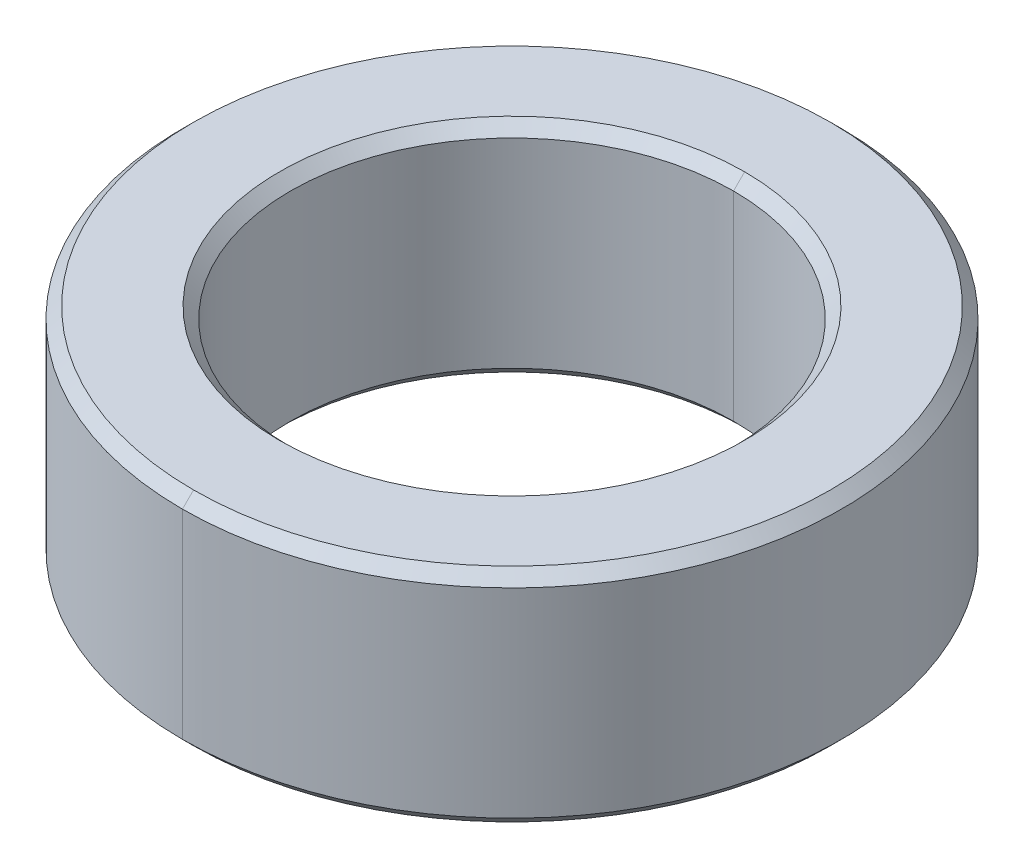
ISO-10303-21;
HEADER;
FILE_DESCRIPTION(('STEP AP214'),'2;1');
FILE_NAME('part.step','',(''),(''),'','','');
FILE_SCHEMA(('AUTOMOTIVE_DESIGN { 1 0 10303 214 1 1 1 1 }'));
ENDSEC;
DATA;
#1=APPLICATION_CONTEXT('core data for automotive mechanical design processes');
#2=APPLICATION_PROTOCOL_DEFINITION('international standard','automotive_design',2000,#1);
#3=PRODUCT_CONTEXT('',#1,'mechanical');
#4=PRODUCT('Part','Part','',(#3));
#5=PRODUCT_RELATED_PRODUCT_CATEGORY('part','',(#4));
#6=PRODUCT_DEFINITION_FORMATION('','',#4);
#7=PRODUCT_DEFINITION_CONTEXT('part definition',#1,'design');
#8=PRODUCT_DEFINITION('design','',#6,#7);
#9=PRODUCT_DEFINITION_SHAPE('','',#8);
#10=(LENGTH_UNIT() NAMED_UNIT(*) SI_UNIT(.MILLI.,.METRE.));
#11=(NAMED_UNIT(*) PLANE_ANGLE_UNIT() SI_UNIT($,.RADIAN.));
#12=(NAMED_UNIT(*) SI_UNIT($,.STERADIAN.) SOLID_ANGLE_UNIT());
#13=UNCERTAINTY_MEASURE_WITH_UNIT(LENGTH_MEASURE(1.E-05),#10,'distance_accuracy_value','');
#14=(GEOMETRIC_REPRESENTATION_CONTEXT(3) GLOBAL_UNCERTAINTY_ASSIGNED_CONTEXT((#13)) GLOBAL_UNIT_ASSIGNED_CONTEXT((#10,
#11,#12)) REPRESENTATION_CONTEXT('',''));
#15=CARTESIAN_POINT('',(0.,0.,0.));
#16=DIRECTION('',(0.,0.,1.));
#17=DIRECTION('',(1.,0.,0.));
#18=AXIS2_PLACEMENT_3D('',#15,#16,#17);
#19=CARTESIAN_POINT('',(0.,0.9,0.));
#20=DIRECTION('',(0.,1.,0.));
#21=DIRECTION('',(0.,0.,1.));
#22=AXIS2_PLACEMENT_3D('',#19,#20,#21);
#23=CONICAL_SURFACE('',#22,2.,0.785398163397459);
#24=DIRECTION('',(0.,0.70710678118654,-0.707106781186555));
#25=VECTOR('',#24,1.);
#26=CARTESIAN_POINT('',(0.,0.9,-2.));
#27=LINE('',#26,#25);
#28=CARTESIAN_POINT('',(0.,0.9,-2.));
#29=VERTEX_POINT('',#28);
#30=CARTESIAN_POINT('',(0.,1.,-2.1));
#31=VERTEX_POINT('',#30);
#32=EDGE_CURVE('E112',#29,#31,#27,.T.);
#33=ORIENTED_EDGE('',*,*,#32,.F.);
#34=CARTESIAN_POINT('',(0.,0.9,0.));
#35=DIRECTION('',(0.,1.,0.));
#36=DIRECTION('',(0.,0.,1.));
#37=AXIS2_PLACEMENT_3D('',#34,#35,#36);
#38=CIRCLE('',#37,2.);
#39=CARTESIAN_POINT('',(0.,0.9,2.));
#40=VERTEX_POINT('',#39);
#41=EDGE_CURVE('E25',#40,#29,#38,.T.);
#42=ORIENTED_EDGE('',*,*,#41,.F.);
#43=DIRECTION('',(0.,0.70710678118654,0.707106781186555));
#44=VECTOR('',#43,1.);
#45=CARTESIAN_POINT('',(0.,0.9,2.));
#46=LINE('',#45,#44);
#47=CARTESIAN_POINT('',(0.,1.,2.1));
#48=VERTEX_POINT('',#47);
#49=EDGE_CURVE('E109',#40,#48,#46,.T.);
#50=ORIENTED_EDGE('',*,*,#49,.T.);
#51=CARTESIAN_POINT('',(0.,1.,0.));
#52=DIRECTION('',(0.,-1.,0.));
#53=DIRECTION('',(0.,0.,1.));
#54=AXIS2_PLACEMENT_3D('',#51,#52,#53);
#55=CIRCLE('',#54,2.1);
#56=EDGE_CURVE('E156',#31,#48,#55,.T.);
#57=ORIENTED_EDGE('',*,*,#56,.F.);
#58=EDGE_LOOP('',(#33,#42,#50,#57));
#59=FACE_BOUND('',#58,.T.);
#60=ADVANCED_FACE('F14',(#59),#23,.F.);
#61=CARTESIAN_POINT('',(0.,-1.,0.));
#62=DIRECTION('',(0.,-1.,0.));
#63=DIRECTION('',(0.,0.,-1.));
#64=AXIS2_PLACEMENT_3D('',#61,#62,#63);
#65=CONICAL_SURFACE('',#64,2.1,0.785398163397448);
#66=DIRECTION('',(0.,-0.707106781186548,0.707106781186548));
#67=VECTOR('',#66,1.);
#68=CARTESIAN_POINT('',(0.,-1.,2.1));
#69=LINE('',#68,#67);
#70=CARTESIAN_POINT('',(0.,-0.9,2.));
#71=VERTEX_POINT('',#70);
#72=CARTESIAN_POINT('',(0.,-1.,2.1));
#73=VERTEX_POINT('',#72);
#74=EDGE_CURVE('E169',#71,#73,#69,.T.);
#75=ORIENTED_EDGE('',*,*,#74,.F.);
#76=CARTESIAN_POINT('',(0.,-0.9,0.));
#77=DIRECTION('',(0.,-1.,0.));
#78=DIRECTION('',(0.,0.,1.));
#79=AXIS2_PLACEMENT_3D('',#76,#77,#78);
#80=CIRCLE('',#79,2.);
#81=CARTESIAN_POINT('',(0.,-0.9,-2.));
#82=VERTEX_POINT('',#81);
#83=EDGE_CURVE('E9',#82,#71,#80,.T.);
#84=ORIENTED_EDGE('',*,*,#83,.F.);
#85=DIRECTION('',(0.,-0.707106781186548,-0.707106781186548));
#86=VECTOR('',#85,1.);
#87=CARTESIAN_POINT('',(0.,-1.,-2.1));
#88=LINE('',#87,#86);
#89=CARTESIAN_POINT('',(0.,-1.,-2.1));
#90=VERTEX_POINT('',#89);
#91=EDGE_CURVE('E195',#82,#90,#88,.T.);
#92=ORIENTED_EDGE('',*,*,#91,.T.);
#93=CARTESIAN_POINT('',(0.,-1.,0.));
#94=DIRECTION('',(0.,1.,0.));
#95=DIRECTION('',(0.,0.,1.));
#96=AXIS2_PLACEMENT_3D('',#93,#94,#95);
#97=CIRCLE('',#96,2.1);
#98=EDGE_CURVE('E155',#73,#90,#97,.T.);
#99=ORIENTED_EDGE('',*,*,#98,.F.);
#100=EDGE_LOOP('',(#75,#84,#92,#99));
#101=FACE_BOUND('',#100,.T.);
#102=ADVANCED_FACE('F259',(#101),#65,.F.);
#103=CARTESIAN_POINT('',(0.,1.,0.));
#104=DIRECTION('',(0.,-1.,0.));
#105=DIRECTION('',(0.,0.,-1.));
#106=AXIS2_PLACEMENT_3D('',#103,#104,#105);
#107=CONICAL_SURFACE('',#106,2.875,0.785398163397448);
#108=DIRECTION('',(0.,-0.707106781186548,0.707106781186548));
#109=VECTOR('',#108,1.);
#110=CARTESIAN_POINT('',(0.,1.,2.875));
#111=LINE('',#110,#109);
#112=CARTESIAN_POINT('',(0.,1.,2.875));
#113=VERTEX_POINT('',#112);
#114=CARTESIAN_POINT('',(0.,0.9,2.975));
#115=VERTEX_POINT('',#114);
#116=EDGE_CURVE('E189',#113,#115,#111,.T.);
#117=ORIENTED_EDGE('',*,*,#116,.F.);
#118=CARTESIAN_POINT('',(0.,1.,0.));
#119=DIRECTION('',(0.,1.,0.));
#120=DIRECTION('',(0.,0.,1.));
#121=AXIS2_PLACEMENT_3D('',#118,#119,#120);
#122=CIRCLE('',#121,2.875);
#123=CARTESIAN_POINT('',(0.,1.,-2.875));
#124=VERTEX_POINT('',#123);
#125=EDGE_CURVE('E174',#124,#113,#122,.T.);
#126=ORIENTED_EDGE('',*,*,#125,.F.);
#127=DIRECTION('',(0.,-0.707106781186548,-0.707106781186548));
#128=VECTOR('',#127,1.);
#129=CARTESIAN_POINT('',(0.,1.,-2.875));
#130=LINE('',#129,#128);
#131=CARTESIAN_POINT('',(0.,0.9,-2.975));
#132=VERTEX_POINT('',#131);
#133=EDGE_CURVE('E147',#124,#132,#130,.T.);
#134=ORIENTED_EDGE('',*,*,#133,.T.);
#135=CARTESIAN_POINT('',(0.,0.9,0.));
#136=DIRECTION('',(0.,-1.,0.));
#137=DIRECTION('',(0.,0.,1.));
#138=AXIS2_PLACEMENT_3D('',#135,#136,#137);
#139=CIRCLE('',#138,2.975);
#140=EDGE_CURVE('E162',#115,#132,#139,.T.);
#141=ORIENTED_EDGE('',*,*,#140,.F.);
#142=EDGE_LOOP('',(#117,#126,#134,#141));
#143=FACE_BOUND('',#142,.T.);
#144=ADVANCED_FACE('F215',(#143),#107,.T.);
#145=CARTESIAN_POINT('',(0.,-0.9,0.));
#146=DIRECTION('',(0.,1.,0.));
#147=DIRECTION('',(0.,0.,1.));
#148=AXIS2_PLACEMENT_3D('',#145,#146,#147);
#149=CONICAL_SURFACE('',#148,2.975,0.785398163397453);
#150=DIRECTION('',(0.,0.707106781186544,-0.707106781186551));
#151=VECTOR('',#150,1.);
#152=CARTESIAN_POINT('',(0.,-0.9,-2.975));
#153=LINE('',#152,#151);
#154=CARTESIAN_POINT('',(0.,-1.,-2.875));
#155=VERTEX_POINT('',#154);
#156=CARTESIAN_POINT('',(0.,-0.9,-2.975));
#157=VERTEX_POINT('',#156);
#158=EDGE_CURVE('E145',#155,#157,#153,.T.);
#159=ORIENTED_EDGE('',*,*,#158,.F.);
#160=CARTESIAN_POINT('',(0.,-1.,0.));
#161=DIRECTION('',(0.,-1.,0.));
#162=DIRECTION('',(0.,0.,1.));
#163=AXIS2_PLACEMENT_3D('',#160,#161,#162);
#164=CIRCLE('',#163,2.875);
#165=CARTESIAN_POINT('',(0.,-1.,2.875));
#166=VERTEX_POINT('',#165);
#167=EDGE_CURVE('E152',#166,#155,#164,.T.);
#168=ORIENTED_EDGE('',*,*,#167,.F.);
#169=DIRECTION('',(0.,0.707106781186544,0.707106781186551));
#170=VECTOR('',#169,1.);
#171=CARTESIAN_POINT('',(0.,-0.9,2.975));
#172=LINE('',#171,#170);
#173=CARTESIAN_POINT('',(0.,-0.9,2.975));
#174=VERTEX_POINT('',#173);
#175=EDGE_CURVE('E124',#166,#174,#172,.T.);
#176=ORIENTED_EDGE('',*,*,#175,.T.);
#177=CARTESIAN_POINT('',(0.,-0.9,0.));
#178=DIRECTION('',(0.,1.,0.));
#179=DIRECTION('',(0.,0.,1.));
#180=AXIS2_PLACEMENT_3D('',#177,#178,#179);
#181=CIRCLE('',#180,2.975);
#182=EDGE_CURVE('E40',#157,#174,#181,.T.);
#183=ORIENTED_EDGE('',*,*,#182,.F.);
#184=EDGE_LOOP('',(#159,#168,#176,#183));
#185=FACE_BOUND('',#184,.T.);
#186=ADVANCED_FACE('F247',(#185),#149,.T.);
#187=CARTESIAN_POINT('',(0.,1.,0.));
#188=DIRECTION('',(0.,-1.,0.));
#189=DIRECTION('',(0.,0.,-1.));
#190=AXIS2_PLACEMENT_3D('',#187,#188,#189);
#191=CYLINDRICAL_SURFACE('',#190,2.);
#192=DIRECTION('',(0.,-1.,0.));
#193=VECTOR('',#192,1.);
#194=CARTESIAN_POINT('',(0.,1.,2.));
#195=LINE('',#194,#193);
#196=EDGE_CURVE('E117',#40,#71,#195,.T.);
#197=ORIENTED_EDGE('',*,*,#196,.F.);
#198=ORIENTED_EDGE('',*,*,#41,.T.);
#199=DIRECTION('',(0.,-1.,0.));
#200=VECTOR('',#199,1.);
#201=CARTESIAN_POINT('',(0.,1.,-2.));
#202=LINE('',#201,#200);
#203=EDGE_CURVE('E123',#29,#82,#202,.T.);
#204=ORIENTED_EDGE('',*,*,#203,.T.);
#205=ORIENTED_EDGE('',*,*,#83,.T.);
#206=EDGE_LOOP('',(#197,#198,#204,#205));
#207=FACE_BOUND('',#206,.T.);
#208=ADVANCED_FACE('F118',(#207),#191,.F.);
#209=CARTESIAN_POINT('',(0.,1.,0.));
#210=DIRECTION('',(0.,-1.,0.));
#211=DIRECTION('',(0.,0.,-1.));
#212=AXIS2_PLACEMENT_3D('',#209,#210,#211);
#213=CYLINDRICAL_SURFACE('',#212,2.975);
#214=DIRECTION('',(0.,-1.,0.));
#215=VECTOR('',#214,1.);
#216=CARTESIAN_POINT('',(0.,1.,2.975));
#217=LINE('',#216,#215);
#218=EDGE_CURVE('E163',#115,#174,#217,.T.);
#219=ORIENTED_EDGE('',*,*,#218,.F.);
#220=ORIENTED_EDGE('',*,*,#140,.T.);
#221=DIRECTION('',(0.,-1.,0.));
#222=VECTOR('',#221,1.);
#223=CARTESIAN_POINT('',(0.,1.,-2.975));
#224=LINE('',#223,#222);
#225=EDGE_CURVE('E166',#132,#157,#224,.T.);
#226=ORIENTED_EDGE('',*,*,#225,.T.);
#227=ORIENTED_EDGE('',*,*,#182,.T.);
#228=EDGE_LOOP('',(#219,#220,#226,#227));
#229=FACE_BOUND('',#228,.T.);
#230=ADVANCED_FACE('F248',(#229),#213,.T.);
#231=CARTESIAN_POINT('',(0.,-1.,0.));
#232=DIRECTION('',(0.,1.,0.));
#233=DIRECTION('',(1.,0.,0.));
#234=AXIS2_PLACEMENT_3D('',#231,#232,#233);
#235=PLANE('',#234);
#236=CARTESIAN_POINT('',(0.,-1.,0.));
#237=DIRECTION('',(0.,1.,0.));
#238=DIRECTION('',(0.,0.,1.));
#239=AXIS2_PLACEMENT_3D('',#236,#237,#238);
#240=CIRCLE('',#239,2.1);
#241=EDGE_CURVE('E184',#90,#73,#240,.T.);
#242=ORIENTED_EDGE('',*,*,#241,.T.);
#243=ORIENTED_EDGE('',*,*,#98,.T.);
#244=EDGE_LOOP('',(#242,#243));
#245=FACE_BOUND('',#244,.T.);
#246=ORIENTED_EDGE('',*,*,#167,.T.);
#247=CARTESIAN_POINT('',(0.,-1.,0.));
#248=DIRECTION('',(0.,-1.,0.));
#249=DIRECTION('',(0.,0.,1.));
#250=AXIS2_PLACEMENT_3D('',#247,#248,#249);
#251=CIRCLE('',#250,2.875);
#252=EDGE_CURVE('E150',#155,#166,#251,.T.);
#253=ORIENTED_EDGE('',*,*,#252,.T.);
#254=EDGE_LOOP('',(#246,#253));
#255=FACE_BOUND('',#254,.T.);
#256=ADVANCED_FACE('F207',(#245,#255),#235,.F.);
#257=CARTESIAN_POINT('',(0.,1.,0.));
#258=DIRECTION('',(0.,1.,0.));
#259=DIRECTION('',(1.,0.,0.));
#260=AXIS2_PLACEMENT_3D('',#257,#258,#259);
#261=PLANE('',#260);
#262=CARTESIAN_POINT('',(0.,1.,0.));
#263=DIRECTION('',(0.,-1.,0.));
#264=DIRECTION('',(0.,0.,1.));
#265=AXIS2_PLACEMENT_3D('',#262,#263,#264);
#266=CIRCLE('',#265,2.1);
#267=EDGE_CURVE('E130',#48,#31,#266,.T.);
#268=ORIENTED_EDGE('',*,*,#267,.T.);
#269=ORIENTED_EDGE('',*,*,#56,.T.);
#270=EDGE_LOOP('',(#268,#269));
#271=FACE_BOUND('',#270,.T.);
#272=ORIENTED_EDGE('',*,*,#125,.T.);
#273=CARTESIAN_POINT('',(0.,1.,0.));
#274=DIRECTION('',(0.,1.,0.));
#275=DIRECTION('',(0.,0.,1.));
#276=AXIS2_PLACEMENT_3D('',#273,#274,#275);
#277=CIRCLE('',#276,2.875);
#278=EDGE_CURVE('E18',#113,#124,#277,.T.);
#279=ORIENTED_EDGE('',*,*,#278,.T.);
#280=EDGE_LOOP('',(#272,#279));
#281=FACE_BOUND('',#280,.T.);
#282=ADVANCED_FACE('F203',(#271,#281),#261,.T.);
#283=CARTESIAN_POINT('',(0.,1.,0.));
#284=DIRECTION('',(0.,-1.,0.));
#285=DIRECTION('',(0.,0.,-1.));
#286=AXIS2_PLACEMENT_3D('',#283,#284,#285);
#287=CYLINDRICAL_SURFACE('',#286,2.975);
#288=CARTESIAN_POINT('',(0.,0.9,0.));
#289=DIRECTION('',(0.,-1.,0.));
#290=DIRECTION('',(0.,0.,1.));
#291=AXIS2_PLACEMENT_3D('',#288,#289,#290);
#292=CIRCLE('',#291,2.975);
#293=EDGE_CURVE('E151',#132,#115,#292,.T.);
#294=ORIENTED_EDGE('',*,*,#293,.T.);
#295=ORIENTED_EDGE('',*,*,#218,.T.);
#296=CARTESIAN_POINT('',(0.,-0.9,0.));
#297=DIRECTION('',(0.,1.,0.));
#298=DIRECTION('',(0.,0.,1.));
#299=AXIS2_PLACEMENT_3D('',#296,#297,#298);
#300=CIRCLE('',#299,2.975);
#301=EDGE_CURVE('E178',#174,#157,#300,.T.);
#302=ORIENTED_EDGE('',*,*,#301,.T.);
#303=ORIENTED_EDGE('',*,*,#225,.F.);
#304=EDGE_LOOP('',(#294,#295,#302,#303));
#305=FACE_BOUND('',#304,.T.);
#306=ADVANCED_FACE('F206',(#305),#287,.T.);
#307=CARTESIAN_POINT('',(0.,1.,0.));
#308=DIRECTION('',(0.,-1.,0.));
#309=DIRECTION('',(0.,0.,-1.));
#310=AXIS2_PLACEMENT_3D('',#307,#308,#309);
#311=CYLINDRICAL_SURFACE('',#310,2.);
#312=CARTESIAN_POINT('',(0.,0.9,0.));
#313=DIRECTION('',(0.,1.,0.));
#314=DIRECTION('',(0.,0.,1.));
#315=AXIS2_PLACEMENT_3D('',#312,#313,#314);
#316=CIRCLE('',#315,2.);
#317=EDGE_CURVE('E128',#29,#40,#316,.T.);
#318=ORIENTED_EDGE('',*,*,#317,.T.);
#319=ORIENTED_EDGE('',*,*,#196,.T.);
#320=CARTESIAN_POINT('',(0.,-0.9,0.));
#321=DIRECTION('',(0.,-1.,0.));
#322=DIRECTION('',(0.,0.,1.));
#323=AXIS2_PLACEMENT_3D('',#320,#321,#322);
#324=CIRCLE('',#323,2.);
#325=EDGE_CURVE('E132',#71,#82,#324,.T.);
#326=ORIENTED_EDGE('',*,*,#325,.T.);
#327=ORIENTED_EDGE('',*,*,#203,.F.);
#328=EDGE_LOOP('',(#318,#319,#326,#327));
#329=FACE_BOUND('',#328,.T.);
#330=ADVANCED_FACE('F134',(#329),#311,.F.);
#331=CARTESIAN_POINT('',(0.,-0.9,0.));
#332=DIRECTION('',(0.,1.,0.));
#333=DIRECTION('',(0.,0.,1.));
#334=AXIS2_PLACEMENT_3D('',#331,#332,#333);
#335=CONICAL_SURFACE('',#334,2.975,0.785398163397453);
#336=ORIENTED_EDGE('',*,*,#252,.F.);
#337=ORIENTED_EDGE('',*,*,#158,.T.);
#338=ORIENTED_EDGE('',*,*,#301,.F.);
#339=ORIENTED_EDGE('',*,*,#175,.F.);
#340=EDGE_LOOP('',(#336,#337,#338,#339));
#341=FACE_BOUND('',#340,.T.);
#342=ADVANCED_FACE('F244',(#341),#335,.T.);
#343=CARTESIAN_POINT('',(0.,1.,0.));
#344=DIRECTION('',(0.,-1.,0.));
#345=DIRECTION('',(0.,0.,-1.));
#346=AXIS2_PLACEMENT_3D('',#343,#344,#345);
#347=CONICAL_SURFACE('',#346,2.875,0.785398163397448);
#348=ORIENTED_EDGE('',*,*,#278,.F.);
#349=ORIENTED_EDGE('',*,*,#116,.T.);
#350=ORIENTED_EDGE('',*,*,#293,.F.);
#351=ORIENTED_EDGE('',*,*,#133,.F.);
#352=EDGE_LOOP('',(#348,#349,#350,#351));
#353=FACE_BOUND('',#352,.T.);
#354=ADVANCED_FACE('F218',(#353),#347,.T.);
#355=CARTESIAN_POINT('',(0.,-1.,0.));
#356=DIRECTION('',(0.,-1.,0.));
#357=DIRECTION('',(0.,0.,-1.));
#358=AXIS2_PLACEMENT_3D('',#355,#356,#357);
#359=CONICAL_SURFACE('',#358,2.1,0.785398163397448);
#360=ORIENTED_EDGE('',*,*,#325,.F.);
#361=ORIENTED_EDGE('',*,*,#74,.T.);
#362=ORIENTED_EDGE('',*,*,#241,.F.);
#363=ORIENTED_EDGE('',*,*,#91,.F.);
#364=EDGE_LOOP('',(#360,#361,#362,#363));
#365=FACE_BOUND('',#364,.T.);
#366=ADVANCED_FACE('F16',(#365),#359,.F.);
#367=CARTESIAN_POINT('',(0.,0.9,0.));
#368=DIRECTION('',(0.,1.,0.));
#369=DIRECTION('',(0.,0.,1.));
#370=AXIS2_PLACEMENT_3D('',#367,#368,#369);
#371=CONICAL_SURFACE('',#370,2.,0.785398163397459);
#372=ORIENTED_EDGE('',*,*,#317,.F.);
#373=ORIENTED_EDGE('',*,*,#32,.T.);
#374=ORIENTED_EDGE('',*,*,#267,.F.);
#375=ORIENTED_EDGE('',*,*,#49,.F.);
#376=EDGE_LOOP('',(#372,#373,#374,#375));
#377=FACE_BOUND('',#376,.T.);
#378=ADVANCED_FACE('F127',(#377),#371,.F.);
#379=CLOSED_SHELL('',(#60,#102,#144,#186,#208,#230,#256,#282,#306,#330,#342,#354,#366,#378));
#380=MANIFOLD_SOLID_BREP('B1',#379);
#381=ADVANCED_BREP_SHAPE_REPRESENTATION('',(#18,#380),#14);
#382=SHAPE_DEFINITION_REPRESENTATION(#9,#381);
ENDSEC;
END-ISO-10303-21;
